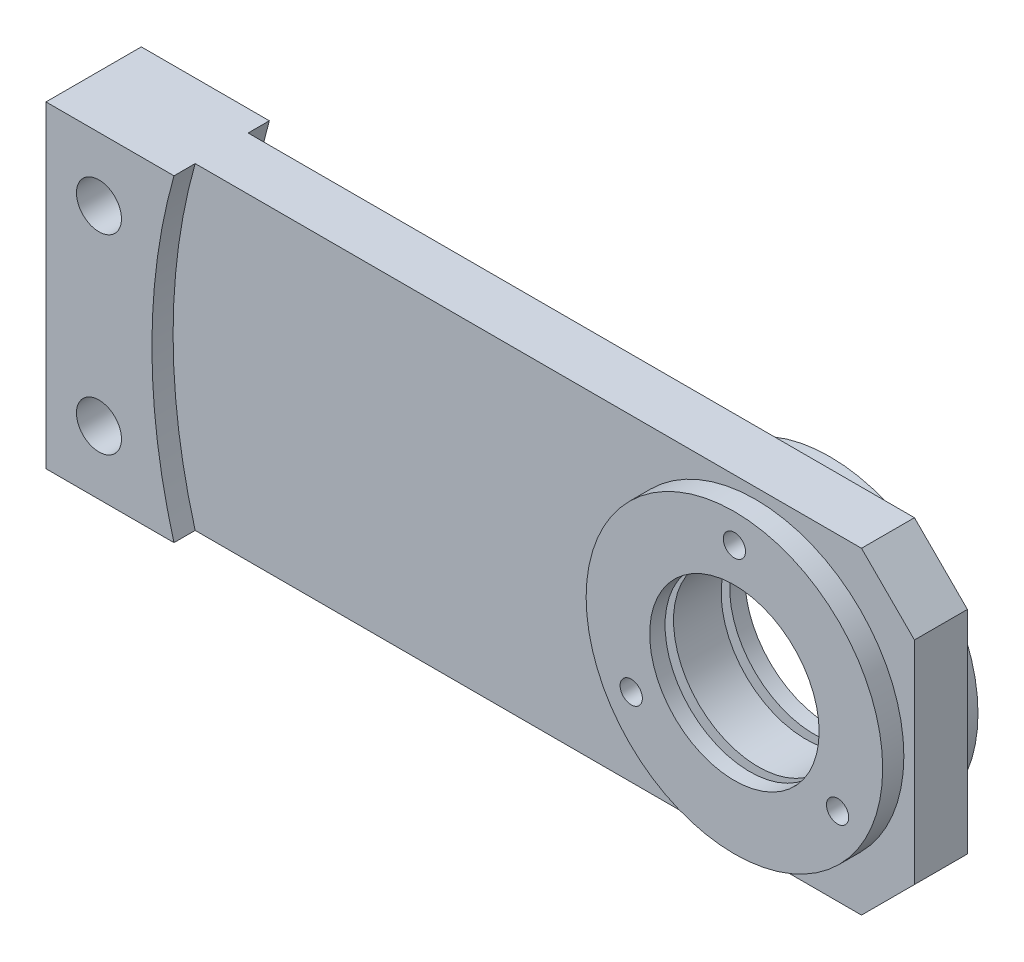
ISO-10303-21;
HEADER;
FILE_DESCRIPTION(('STEP AP214'),'2;1');
FILE_NAME('part.step','',(''),(''),'','','');
FILE_SCHEMA(('AUTOMOTIVE_DESIGN { 1 0 10303 214 1 1 1 1 }'));
ENDSEC;
DATA;
#1=APPLICATION_CONTEXT('core data for automotive mechanical design processes');
#2=APPLICATION_PROTOCOL_DEFINITION('international standard','automotive_design',2000,#1);
#3=PRODUCT_CONTEXT('',#1,'mechanical');
#4=PRODUCT('Part','Part','',(#3));
#5=PRODUCT_RELATED_PRODUCT_CATEGORY('part','',(#4));
#6=PRODUCT_DEFINITION_FORMATION('','',#4);
#7=PRODUCT_DEFINITION_CONTEXT('part definition',#1,'design');
#8=PRODUCT_DEFINITION('design','',#6,#7);
#9=PRODUCT_DEFINITION_SHAPE('','',#8);
#10=(LENGTH_UNIT() NAMED_UNIT(*) SI_UNIT(.MILLI.,.METRE.));
#11=(NAMED_UNIT(*) PLANE_ANGLE_UNIT() SI_UNIT($,.RADIAN.));
#12=(NAMED_UNIT(*) SI_UNIT($,.STERADIAN.) SOLID_ANGLE_UNIT());
#13=UNCERTAINTY_MEASURE_WITH_UNIT(LENGTH_MEASURE(1.E-05),#10,'distance_accuracy_value','');
#14=(GEOMETRIC_REPRESENTATION_CONTEXT(3) GLOBAL_UNCERTAINTY_ASSIGNED_CONTEXT((#13)) GLOBAL_UNIT_ASSIGNED_CONTEXT((#10,
#11,#12)) REPRESENTATION_CONTEXT('',''));
#15=CARTESIAN_POINT('',(0.,0.,0.));
#16=DIRECTION('',(0.,0.,1.));
#17=DIRECTION('',(1.,0.,0.));
#18=AXIS2_PLACEMENT_3D('',#15,#16,#17);
#19=CARTESIAN_POINT('',(80.,30.,9.));
#20=DIRECTION('',(-1.,0.,0.));
#21=DIRECTION('',(0.,0.,1.));
#22=AXIS2_PLACEMENT_3D('',#19,#20,#21);
#23=PLANE('',#22);
#24=DIRECTION('',(0.,1.,0.));
#25=VECTOR('',#24,1.);
#26=CARTESIAN_POINT('',(80.,0.,-5.));
#27=LINE('',#26,#25);
#28=CARTESIAN_POINT('',(80.,-20.,-5.));
#29=VERTEX_POINT('',#28);
#30=CARTESIAN_POINT('',(80.,20.,-5.));
#31=VERTEX_POINT('',#30);
#32=EDGE_CURVE('E147',#29,#31,#27,.T.);
#33=ORIENTED_EDGE('',*,*,#32,.T.);
#34=DIRECTION('',(0.,0.,1.));
#35=VECTOR('',#34,1.);
#36=CARTESIAN_POINT('',(80.,20.,9.));
#37=LINE('',#36,#35);
#38=CARTESIAN_POINT('',(80.,20.,5.));
#39=VERTEX_POINT('',#38);
#40=EDGE_CURVE('E53',#31,#39,#37,.T.);
#41=ORIENTED_EDGE('',*,*,#40,.T.);
#42=DIRECTION('',(0.,1.,0.));
#43=VECTOR('',#42,1.);
#44=CARTESIAN_POINT('',(80.,0.,5.));
#45=LINE('',#44,#43);
#46=CARTESIAN_POINT('',(80.,-20.,5.));
#47=VERTEX_POINT('',#46);
#48=EDGE_CURVE('E166',#47,#39,#45,.T.);
#49=ORIENTED_EDGE('',*,*,#48,.F.);
#50=DIRECTION('',(0.,0.,-1.));
#51=VECTOR('',#50,1.);
#52=CARTESIAN_POINT('',(80.,-20.,9.));
#53=LINE('',#52,#51);
#54=EDGE_CURVE('E154',#47,#29,#53,.T.);
#55=ORIENTED_EDGE('',*,*,#54,.T.);
#56=EDGE_LOOP('',(#33,#41,#49,#55));
#57=FACE_BOUND('',#56,.T.);
#58=ADVANCED_FACE('F44',(#57),#23,.F.);
#59=CARTESIAN_POINT('',(70.,30.,9.));
#60=DIRECTION('',(-0.707106781186549,-0.707106781186546,0.));
#61=DIRECTION('',(0.,0.,-1.));
#62=AXIS2_PLACEMENT_3D('',#59,#60,#61);
#63=PLANE('',#62);
#64=ORIENTED_EDGE('',*,*,#40,.F.);
#65=DIRECTION('',(-0.707106781186546,0.707106781186549,0.));
#66=VECTOR('',#65,1.);
#67=CARTESIAN_POINT('',(50.0000000000002,50.,-5.));
#68=LINE('',#67,#66);
#69=CARTESIAN_POINT('',(70.,30.,-5.));
#70=VERTEX_POINT('',#69);
#71=EDGE_CURVE('E133',#31,#70,#68,.T.);
#72=ORIENTED_EDGE('',*,*,#71,.T.);
#73=DIRECTION('',(0.,0.,-1.));
#74=VECTOR('',#73,1.);
#75=CARTESIAN_POINT('',(70.,30.,9.));
#76=LINE('',#75,#74);
#77=CARTESIAN_POINT('',(70.,30.,5.));
#78=VERTEX_POINT('',#77);
#79=EDGE_CURVE('E146',#78,#70,#76,.T.);
#80=ORIENTED_EDGE('',*,*,#79,.F.);
#81=DIRECTION('',(-0.707106781186546,0.707106781186549,0.));
#82=VECTOR('',#81,1.);
#83=CARTESIAN_POINT('',(50.0000000000002,50.,5.));
#84=LINE('',#83,#82);
#85=EDGE_CURVE('E170',#39,#78,#84,.T.);
#86=ORIENTED_EDGE('',*,*,#85,.F.);
#87=EDGE_LOOP('',(#64,#72,#80,#86));
#88=FACE_BOUND('',#87,.T.);
#89=ADVANCED_FACE('F144',(#88),#63,.F.);
#90=CARTESIAN_POINT('',(80.,-20.,9.));
#91=DIRECTION('',(-0.707106781186546,0.707106781186549,0.));
#92=DIRECTION('',(0.,0.,-1.));
#93=AXIS2_PLACEMENT_3D('',#90,#91,#92);
#94=PLANE('',#93);
#95=DIRECTION('',(0.,0.,1.));
#96=VECTOR('',#95,1.);
#97=CARTESIAN_POINT('',(70.,-30.,9.));
#98=LINE('',#97,#96);
#99=CARTESIAN_POINT('',(70.,-30.,-5.));
#100=VERTEX_POINT('',#99);
#101=CARTESIAN_POINT('',(70.,-30.,5.));
#102=VERTEX_POINT('',#101);
#103=EDGE_CURVE('E11',#100,#102,#98,.T.);
#104=ORIENTED_EDGE('',*,*,#103,.F.);
#105=DIRECTION('',(0.707106781186549,0.707106781186546,0.));
#106=VECTOR('',#105,1.);
#107=CARTESIAN_POINT('',(49.9999999999998,-50.0000000000001,-5.));
#108=LINE('',#107,#106);
#109=EDGE_CURVE('E295',#100,#29,#108,.T.);
#110=ORIENTED_EDGE('',*,*,#109,.T.);
#111=ORIENTED_EDGE('',*,*,#54,.F.);
#112=DIRECTION('',(0.707106781186549,0.707106781186546,0.));
#113=VECTOR('',#112,1.);
#114=CARTESIAN_POINT('',(49.9999999999998,-50.0000000000001,5.));
#115=LINE('',#114,#113);
#116=EDGE_CURVE('E172',#102,#47,#115,.T.);
#117=ORIENTED_EDGE('',*,*,#116,.F.);
#118=EDGE_LOOP('',(#104,#110,#111,#117));
#119=FACE_BOUND('',#118,.T.);
#120=ADVANCED_FACE('F47',(#119),#94,.F.);
#121=CARTESIAN_POINT('',(0.,0.,-9.));
#122=DIRECTION('',(0.,0.,-1.));
#123=DIRECTION('',(-1.,0.,0.));
#124=AXIS2_PLACEMENT_3D('',#121,#122,#123);
#125=PLANE('',#124);
#126=CARTESIAN_POINT('',(-70.,-18.,-9.));
#127=DIRECTION('',(0.,0.,1.));
#128=DIRECTION('',(1.,0.,0.));
#129=AXIS2_PLACEMENT_3D('',#126,#127,#128);
#130=CIRCLE('',#129,4.25);
#131=CARTESIAN_POINT('',(-65.75,-18.,-9.));
#132=VERTEX_POINT('',#131);
#133=EDGE_CURVE('E234',#132,#132,#130,.T.);
#134=ORIENTED_EDGE('',*,*,#133,.T.);
#135=EDGE_LOOP('',(#134));
#136=FACE_BOUND('',#135,.T.);
#137=CARTESIAN_POINT('',(-70.,18.,-9.));
#138=DIRECTION('',(0.,0.,1.));
#139=DIRECTION('',(1.,0.,0.));
#140=AXIS2_PLACEMENT_3D('',#137,#138,#139);
#141=CIRCLE('',#140,4.25);
#142=CARTESIAN_POINT('',(-65.75,18.,-9.));
#143=VERTEX_POINT('',#142);
#144=EDGE_CURVE('E240',#143,#143,#141,.T.);
#145=ORIENTED_EDGE('',*,*,#144,.T.);
#146=EDGE_LOOP('',(#145));
#147=FACE_BOUND('',#146,.T.);
#148=DIRECTION('',(-1.,0.,0.));
#149=VECTOR('',#148,1.);
#150=CARTESIAN_POINT('',(80.,30.,-9.));
#151=LINE('',#150,#149);
#152=CARTESIAN_POINT('',(-55.8300524425836,30.,-9.));
#153=VERTEX_POINT('',#152);
#154=CARTESIAN_POINT('',(-80.,30.,-9.));
#155=VERTEX_POINT('',#154);
#156=EDGE_CURVE('E253',#153,#155,#151,.T.);
#157=ORIENTED_EDGE('',*,*,#156,.F.);
#158=CARTESIAN_POINT('',(50.,0.,-9.));
#159=DIRECTION('',(0.,0.,1.));
#160=DIRECTION('',(1.,0.,0.));
#161=AXIS2_PLACEMENT_3D('',#158,#159,#160);
#162=CIRCLE('',#161,110.);
#163=CARTESIAN_POINT('',(-55.8300524425836,-30.,-9.));
#164=VERTEX_POINT('',#163);
#165=EDGE_CURVE('E275',#153,#164,#162,.T.);
#166=ORIENTED_EDGE('',*,*,#165,.T.);
#167=DIRECTION('',(1.,0.,0.));
#168=VECTOR('',#167,1.);
#169=CARTESIAN_POINT('',(80.,-30.,-9.));
#170=LINE('',#169,#168);
#171=CARTESIAN_POINT('',(-80.,-30.,-9.));
#172=VERTEX_POINT('',#171);
#173=EDGE_CURVE('E260',#172,#164,#170,.T.);
#174=ORIENTED_EDGE('',*,*,#173,.F.);
#175=DIRECTION('',(0.,-1.,0.));
#176=VECTOR('',#175,1.);
#177=CARTESIAN_POINT('',(-80.,30.,-9.));
#178=LINE('',#177,#176);
#179=EDGE_CURVE('E246',#155,#172,#178,.T.);
#180=ORIENTED_EDGE('',*,*,#179,.F.);
#181=EDGE_LOOP('',(#157,#166,#174,#180));
#182=FACE_BOUND('',#181,.T.);
#183=ADVANCED_FACE('F273',(#136,#147,#182),#125,.T.);
#184=CARTESIAN_POINT('',(80.,-30.,9.));
#185=DIRECTION('',(0.,1.,0.));
#186=DIRECTION('',(-1.,0.,0.));
#187=AXIS2_PLACEMENT_3D('',#184,#185,#186);
#188=PLANE('',#187);
#189=DIRECTION('',(0.,0.,-1.));
#190=VECTOR('',#189,1.);
#191=CARTESIAN_POINT('',(-55.8300524425836,-30.,-5.));
#192=LINE('',#191,#190);
#193=CARTESIAN_POINT('',(-55.8300524425836,-30.,-5.));
#194=VERTEX_POINT('',#193);
#195=EDGE_CURVE('E302',#194,#164,#192,.T.);
#196=ORIENTED_EDGE('',*,*,#195,.F.);
#197=DIRECTION('',(1.,0.,0.));
#198=VECTOR('',#197,1.);
#199=CARTESIAN_POINT('',(0.,-30.,-5.));
#200=LINE('',#199,#198);
#201=EDGE_CURVE('E296',#194,#100,#200,.T.);
#202=ORIENTED_EDGE('',*,*,#201,.T.);
#203=ORIENTED_EDGE('',*,*,#103,.T.);
#204=DIRECTION('',(1.,0.,0.));
#205=VECTOR('',#204,1.);
#206=CARTESIAN_POINT('',(0.,-30.,5.));
#207=LINE('',#206,#205);
#208=CARTESIAN_POINT('',(-55.8300524425836,-30.,5.));
#209=VERTEX_POINT('',#208);
#210=EDGE_CURVE('E286',#209,#102,#207,.T.);
#211=ORIENTED_EDGE('',*,*,#210,.F.);
#212=DIRECTION('',(0.,0.,1.));
#213=VECTOR('',#212,1.);
#214=CARTESIAN_POINT('',(-55.8300524425836,-30.,5.));
#215=LINE('',#214,#213);
#216=CARTESIAN_POINT('',(-55.8300524425836,-30.,9.));
#217=VERTEX_POINT('',#216);
#218=EDGE_CURVE('E176',#209,#217,#215,.T.);
#219=ORIENTED_EDGE('',*,*,#218,.T.);
#220=DIRECTION('',(1.,0.,0.));
#221=VECTOR('',#220,1.);
#222=CARTESIAN_POINT('',(80.,-30.,9.));
#223=LINE('',#222,#221);
#224=CARTESIAN_POINT('',(-80.,-30.,9.));
#225=VERTEX_POINT('',#224);
#226=EDGE_CURVE('E252',#225,#217,#223,.T.);
#227=ORIENTED_EDGE('',*,*,#226,.F.);
#228=DIRECTION('',(0.,0.,-1.));
#229=VECTOR('',#228,1.);
#230=CARTESIAN_POINT('',(-80.,-30.,9.));
#231=LINE('',#230,#229);
#232=EDGE_CURVE('E155',#225,#172,#231,.T.);
#233=ORIENTED_EDGE('',*,*,#232,.T.);
#234=ORIENTED_EDGE('',*,*,#173,.T.);
#235=EDGE_LOOP('',(#196,#202,#203,#211,#219,#227,#233,#234));
#236=FACE_BOUND('',#235,.T.);
#237=ADVANCED_FACE('F277',(#236),#188,.F.);
#238=CARTESIAN_POINT('',(80.,30.,9.));
#239=DIRECTION('',(0.,-1.,0.));
#240=DIRECTION('',(1.,0.,0.));
#241=AXIS2_PLACEMENT_3D('',#238,#239,#240);
#242=PLANE('',#241);
#243=DIRECTION('',(0.,0.,-1.));
#244=VECTOR('',#243,1.);
#245=CARTESIAN_POINT('',(-55.8300524425836,30.,-5.));
#246=LINE('',#245,#244);
#247=CARTESIAN_POINT('',(-55.8300524425836,30.,-5.));
#248=VERTEX_POINT('',#247);
#249=EDGE_CURVE('E60',#248,#153,#246,.T.);
#250=ORIENTED_EDGE('',*,*,#249,.T.);
#251=ORIENTED_EDGE('',*,*,#156,.T.);
#252=DIRECTION('',(0.,0.,-1.));
#253=VECTOR('',#252,1.);
#254=CARTESIAN_POINT('',(-80.,30.,9.));
#255=LINE('',#254,#253);
#256=CARTESIAN_POINT('',(-80.,30.,9.));
#257=VERTEX_POINT('',#256);
#258=EDGE_CURVE('E160',#257,#155,#255,.T.);
#259=ORIENTED_EDGE('',*,*,#258,.F.);
#260=DIRECTION('',(-1.,0.,0.));
#261=VECTOR('',#260,1.);
#262=CARTESIAN_POINT('',(80.,30.,9.));
#263=LINE('',#262,#261);
#264=CARTESIAN_POINT('',(-55.8300524425836,30.,9.));
#265=VERTEX_POINT('',#264);
#266=EDGE_CURVE('E256',#265,#257,#263,.T.);
#267=ORIENTED_EDGE('',*,*,#266,.F.);
#268=DIRECTION('',(0.,0.,1.));
#269=VECTOR('',#268,1.);
#270=CARTESIAN_POINT('',(-55.8300524425836,30.,5.));
#271=LINE('',#270,#269);
#272=CARTESIAN_POINT('',(-55.8300524425836,30.,5.));
#273=VERTEX_POINT('',#272);
#274=EDGE_CURVE('E174',#273,#265,#271,.T.);
#275=ORIENTED_EDGE('',*,*,#274,.F.);
#276=DIRECTION('',(-1.,0.,0.));
#277=VECTOR('',#276,1.);
#278=CARTESIAN_POINT('',(0.,30.,5.));
#279=LINE('',#278,#277);
#280=EDGE_CURVE('E153',#78,#273,#279,.T.);
#281=ORIENTED_EDGE('',*,*,#280,.F.);
#282=ORIENTED_EDGE('',*,*,#79,.T.);
#283=DIRECTION('',(-1.,0.,0.));
#284=VECTOR('',#283,1.);
#285=CARTESIAN_POINT('',(0.,30.,-5.));
#286=LINE('',#285,#284);
#287=EDGE_CURVE('E130',#70,#248,#286,.T.);
#288=ORIENTED_EDGE('',*,*,#287,.T.);
#289=EDGE_LOOP('',(#250,#251,#259,#267,#275,#281,#282,#288));
#290=FACE_BOUND('',#289,.T.);
#291=ADVANCED_FACE('F150',(#290),#242,.F.);
#292=CARTESIAN_POINT('',(0.,0.,9.));
#293=DIRECTION('',(0.,0.,-1.));
#294=DIRECTION('',(-1.,0.,0.));
#295=AXIS2_PLACEMENT_3D('',#292,#293,#294);
#296=PLANE('',#295);
#297=CARTESIAN_POINT('',(69.48557158515,-11.2499999999998,9.));
#298=DIRECTION('',(0.,0.,1.));
#299=DIRECTION('',(1.,0.,0.));
#300=AXIS2_PLACEMENT_3D('',#297,#298,#299);
#301=CIRCLE('',#300,2.09999999999999);
#302=CARTESIAN_POINT('',(71.58557158515,-11.2499999999998,9.));
#303=VERTEX_POINT('',#302);
#304=EDGE_CURVE('E210',#303,#303,#301,.T.);
#305=ORIENTED_EDGE('',*,*,#304,.F.);
#306=EDGE_LOOP('',(#305));
#307=FACE_BOUND('',#306,.T.);
#308=CARTESIAN_POINT('',(30.5144284148502,-11.2500000000001,9.));
#309=DIRECTION('',(0.,0.,1.));
#310=DIRECTION('',(1.,0.,0.));
#311=AXIS2_PLACEMENT_3D('',#308,#309,#310);
#312=CIRCLE('',#311,2.09999999999999);
#313=CARTESIAN_POINT('',(32.6144284148502,-11.2500000000001,9.));
#314=VERTEX_POINT('',#313);
#315=EDGE_CURVE('E218',#314,#314,#312,.T.);
#316=ORIENTED_EDGE('',*,*,#315,.F.);
#317=EDGE_LOOP('',(#316));
#318=FACE_BOUND('',#317,.T.);
#319=CARTESIAN_POINT('',(50.,22.5,9.));
#320=DIRECTION('',(0.,0.,1.));
#321=DIRECTION('',(1.,0.,0.));
#322=AXIS2_PLACEMENT_3D('',#319,#320,#321);
#323=CIRCLE('',#322,2.09999999999999);
#324=CARTESIAN_POINT('',(52.1,22.5,9.));
#325=VERTEX_POINT('',#324);
#326=EDGE_CURVE('E224',#325,#325,#323,.T.);
#327=ORIENTED_EDGE('',*,*,#326,.F.);
#328=EDGE_LOOP('',(#327));
#329=FACE_BOUND('',#328,.T.);
#330=CARTESIAN_POINT('',(50.,0.,9.));
#331=DIRECTION('',(0.,0.,1.));
#332=DIRECTION('',(1.,0.,0.));
#333=AXIS2_PLACEMENT_3D('',#330,#331,#332);
#334=CIRCLE('',#333,16.);
#335=CARTESIAN_POINT('',(66.,0.,9.));
#336=VERTEX_POINT('',#335);
#337=EDGE_CURVE('E231',#336,#336,#334,.T.);
#338=ORIENTED_EDGE('',*,*,#337,.F.);
#339=EDGE_LOOP('',(#338));
#340=FACE_BOUND('',#339,.T.);
#341=CARTESIAN_POINT('',(50.,0.,9.));
#342=DIRECTION('',(0.,0.,1.));
#343=DIRECTION('',(1.,0.,0.));
#344=AXIS2_PLACEMENT_3D('',#341,#342,#343);
#345=CIRCLE('',#344,28.);
#346=CARTESIAN_POINT('',(78.,0.,9.));
#347=VERTEX_POINT('',#346);
#348=EDGE_CURVE('E180',#347,#347,#345,.T.);
#349=ORIENTED_EDGE('',*,*,#348,.T.);
#350=EDGE_LOOP('',(#349));
#351=FACE_BOUND('',#350,.T.);
#352=ADVANCED_FACE('F351',(#307,#318,#329,#340,#351),#296,.F.);
#353=CARTESIAN_POINT('',(50.,0.,9.));
#354=DIRECTION('',(0.,0.,-1.));
#355=DIRECTION('',(-1.,0.,0.));
#356=AXIS2_PLACEMENT_3D('',#353,#354,#355);
#357=CYLINDRICAL_SURFACE('',#356,16.);
#358=CARTESIAN_POINT('',(50.,0.,4.5));
#359=DIRECTION('',(0.,0.,1.));
#360=DIRECTION('',(1.,0.,0.));
#361=AXIS2_PLACEMENT_3D('',#358,#359,#360);
#362=CIRCLE('',#361,16.);
#363=CARTESIAN_POINT('',(66.,0.,4.5));
#364=VERTEX_POINT('',#363);
#365=EDGE_CURVE('E198',#364,#364,#362,.T.);
#366=ORIENTED_EDGE('',*,*,#365,.T.);
#367=EDGE_LOOP('',(#366));
#368=FACE_BOUND('',#367,.T.);
#369=CARTESIAN_POINT('',(50.,0.,-4.5));
#370=DIRECTION('',(0.,0.,1.));
#371=DIRECTION('',(1.,0.,0.));
#372=AXIS2_PLACEMENT_3D('',#369,#370,#371);
#373=CIRCLE('',#372,16.);
#374=CARTESIAN_POINT('',(66.,0.,-4.5));
#375=VERTEX_POINT('',#374);
#376=EDGE_CURVE('E187',#375,#375,#373,.T.);
#377=ORIENTED_EDGE('',*,*,#376,.F.);
#378=EDGE_LOOP('',(#377));
#379=FACE_BOUND('',#378,.T.);
#380=ADVANCED_FACE('F374',(#368,#379),#357,.F.);
#381=CARTESIAN_POINT('',(50.,0.,-6.1));
#382=DIRECTION('',(0.,0.,1.));
#383=DIRECTION('',(1.,0.,0.));
#384=AXIS2_PLACEMENT_3D('',#381,#382,#383);
#385=CIRCLE('',#384,16.);
#386=CARTESIAN_POINT('',(66.,0.,-6.1));
#387=VERTEX_POINT('',#386);
#388=EDGE_CURVE('E189',#387,#387,#385,.T.);
#389=ORIENTED_EDGE('',*,*,#388,.T.);
#390=EDGE_LOOP('',(#389));
#391=FACE_BOUND('',#390,.T.);
#392=CARTESIAN_POINT('',(50.,0.,-9.));
#393=DIRECTION('',(0.,0.,1.));
#394=DIRECTION('',(1.,0.,0.));
#395=AXIS2_PLACEMENT_3D('',#392,#393,#394);
#396=CIRCLE('',#395,16.);
#397=CARTESIAN_POINT('',(66.,0.,-9.));
#398=VERTEX_POINT('',#397);
#399=EDGE_CURVE('E230',#398,#398,#396,.T.);
#400=ORIENTED_EDGE('',*,*,#399,.F.);
#401=EDGE_LOOP('',(#400));
#402=FACE_BOUND('',#401,.T.);
#403=ADVANCED_FACE('F349',(#391,#402),#357,.F.);
#404=ORIENTED_EDGE('',*,*,#226,.T.);
#405=CARTESIAN_POINT('',(50.,0.,9.));
#406=DIRECTION('',(0.,0.,1.));
#407=DIRECTION('',(1.,0.,0.));
#408=AXIS2_PLACEMENT_3D('',#405,#406,#407);
#409=CIRCLE('',#408,110.);
#410=EDGE_CURVE('E183',#265,#217,#409,.T.);
#411=ORIENTED_EDGE('',*,*,#410,.F.);
#412=ORIENTED_EDGE('',*,*,#266,.T.);
#413=DIRECTION('',(0.,-1.,0.));
#414=VECTOR('',#413,1.);
#415=CARTESIAN_POINT('',(-80.,30.,9.));
#416=LINE('',#415,#414);
#417=EDGE_CURVE('E249',#257,#225,#416,.T.);
#418=ORIENTED_EDGE('',*,*,#417,.T.);
#419=EDGE_LOOP('',(#404,#411,#412,#418));
#420=FACE_BOUND('',#419,.T.);
#421=CARTESIAN_POINT('',(-70.,18.,9.));
#422=DIRECTION('',(0.,0.,1.));
#423=DIRECTION('',(1.,0.,0.));
#424=AXIS2_PLACEMENT_3D('',#421,#422,#423);
#425=CIRCLE('',#424,4.25);
#426=CARTESIAN_POINT('',(-65.75,18.,9.));
#427=VERTEX_POINT('',#426);
#428=EDGE_CURVE('E243',#427,#427,#425,.T.);
#429=ORIENTED_EDGE('',*,*,#428,.F.);
#430=EDGE_LOOP('',(#429));
#431=FACE_BOUND('',#430,.T.);
#432=CARTESIAN_POINT('',(-70.,-18.,9.));
#433=DIRECTION('',(0.,0.,1.));
#434=DIRECTION('',(1.,0.,0.));
#435=AXIS2_PLACEMENT_3D('',#432,#433,#434);
#436=CIRCLE('',#435,4.25);
#437=CARTESIAN_POINT('',(-65.75,-18.,9.));
#438=VERTEX_POINT('',#437);
#439=EDGE_CURVE('E237',#438,#438,#436,.T.);
#440=ORIENTED_EDGE('',*,*,#439,.F.);
#441=EDGE_LOOP('',(#440));
#442=FACE_BOUND('',#441,.T.);
#443=ADVANCED_FACE('F280',(#420,#431,#442),#296,.F.);
#444=CARTESIAN_POINT('',(50.,0.,-9.));
#445=DIRECTION('',(0.,0.,1.));
#446=DIRECTION('',(1.,0.,0.));
#447=AXIS2_PLACEMENT_3D('',#444,#445,#446);
#448=CIRCLE('',#447,28.);
#449=CARTESIAN_POINT('',(78.,0.,-9.));
#450=VERTEX_POINT('',#449);
#451=EDGE_CURVE('E303',#450,#450,#448,.T.);
#452=ORIENTED_EDGE('',*,*,#451,.F.);
#453=EDGE_LOOP('',(#452));
#454=FACE_BOUND('',#453,.T.);
#455=ORIENTED_EDGE('',*,*,#399,.T.);
#456=EDGE_LOOP('',(#455));
#457=FACE_BOUND('',#456,.T.);
#458=ADVANCED_FACE('F332',(#454,#457),#125,.T.);
#459=CARTESIAN_POINT('',(-80.,30.,9.));
#460=DIRECTION('',(1.,0.,0.));
#461=DIRECTION('',(0.,0.,-1.));
#462=AXIS2_PLACEMENT_3D('',#459,#460,#461);
#463=PLANE('',#462);
#464=ORIENTED_EDGE('',*,*,#179,.T.);
#465=ORIENTED_EDGE('',*,*,#232,.F.);
#466=ORIENTED_EDGE('',*,*,#417,.F.);
#467=ORIENTED_EDGE('',*,*,#258,.T.);
#468=EDGE_LOOP('',(#464,#465,#466,#467));
#469=FACE_BOUND('',#468,.T.);
#470=ADVANCED_FACE('F268',(#469),#463,.F.);
#471=CARTESIAN_POINT('',(-70.,18.,9.));
#472=DIRECTION('',(0.,0.,-1.));
#473=DIRECTION('',(-1.,0.,0.));
#474=AXIS2_PLACEMENT_3D('',#471,#472,#473);
#475=CYLINDRICAL_SURFACE('',#474,4.25);
#476=ORIENTED_EDGE('',*,*,#428,.T.);
#477=EDGE_LOOP('',(#476));
#478=FACE_BOUND('',#477,.T.);
#479=ORIENTED_EDGE('',*,*,#144,.F.);
#480=EDGE_LOOP('',(#479));
#481=FACE_BOUND('',#480,.T.);
#482=ADVANCED_FACE('F331',(#478,#481),#475,.F.);
#483=CARTESIAN_POINT('',(-70.,-18.,9.));
#484=DIRECTION('',(0.,0.,-1.));
#485=DIRECTION('',(-1.,0.,0.));
#486=AXIS2_PLACEMENT_3D('',#483,#484,#485);
#487=CYLINDRICAL_SURFACE('',#486,4.25);
#488=ORIENTED_EDGE('',*,*,#439,.T.);
#489=EDGE_LOOP('',(#488));
#490=FACE_BOUND('',#489,.T.);
#491=ORIENTED_EDGE('',*,*,#133,.F.);
#492=EDGE_LOOP('',(#491));
#493=FACE_BOUND('',#492,.T.);
#494=ADVANCED_FACE('F342',(#490,#493),#487,.F.);
#495=CARTESIAN_POINT('',(50.,0.,6.1));
#496=DIRECTION('',(0.,0.,1.));
#497=DIRECTION('',(1.,0.,0.));
#498=AXIS2_PLACEMENT_3D('',#495,#496,#497);
#499=CIRCLE('',#498,16.);
#500=CARTESIAN_POINT('',(66.,0.,6.1));
#501=VERTEX_POINT('',#500);
#502=EDGE_CURVE('E201',#501,#501,#499,.T.);
#503=ORIENTED_EDGE('',*,*,#502,.F.);
#504=EDGE_LOOP('',(#503));
#505=FACE_BOUND('',#504,.T.);
#506=ORIENTED_EDGE('',*,*,#337,.T.);
#507=EDGE_LOOP('',(#506));
#508=FACE_BOUND('',#507,.T.);
#509=ADVANCED_FACE('F365',(#505,#508),#357,.F.);
#510=CARTESIAN_POINT('',(50.,22.5,-1.));
#511=DIRECTION('',(0.,0.,1.));
#512=DIRECTION('',(1.,0.,0.));
#513=AXIS2_PLACEMENT_3D('',#510,#511,#512);
#514=CONICAL_SURFACE('',#513,2.1,1.02974425867665);
#515=CARTESIAN_POINT('',(50.,22.5,-2.26180729995788));
#516=VERTEX_POINT('',#515);
#517=VERTEX_LOOP('',#516);
#518=FACE_BOUND('',#517,.T.);
#519=CARTESIAN_POINT('',(50.,22.5,-1.));
#520=DIRECTION('',(0.,0.,1.));
#521=DIRECTION('',(1.,0.,0.));
#522=AXIS2_PLACEMENT_3D('',#519,#520,#521);
#523=CIRCLE('',#522,2.1);
#524=CARTESIAN_POINT('',(52.1,22.5,-1.));
#525=VERTEX_POINT('',#524);
#526=EDGE_CURVE('E227',#525,#525,#523,.T.);
#527=ORIENTED_EDGE('',*,*,#526,.T.);
#528=EDGE_LOOP('',(#527));
#529=FACE_BOUND('',#528,.T.);
#530=ADVANCED_FACE('F371',(#518,#529),#514,.F.);
#531=CARTESIAN_POINT('',(50.,22.5,9.));
#532=DIRECTION('',(0.,0.,1.));
#533=DIRECTION('',(1.,0.,0.));
#534=AXIS2_PLACEMENT_3D('',#531,#532,#533);
#535=CYLINDRICAL_SURFACE('',#534,2.09999999999999);
#536=ORIENTED_EDGE('',*,*,#526,.F.);
#537=EDGE_LOOP('',(#536));
#538=FACE_BOUND('',#537,.T.);
#539=ORIENTED_EDGE('',*,*,#326,.T.);
#540=EDGE_LOOP('',(#539));
#541=FACE_BOUND('',#540,.T.);
#542=ADVANCED_FACE('F378',(#538,#541),#535,.F.);
#543=CARTESIAN_POINT('',(30.5144284148502,-11.2500000000001,-1.));
#544=DIRECTION('',(0.,0.,1.));
#545=DIRECTION('',(1.,0.,0.));
#546=AXIS2_PLACEMENT_3D('',#543,#544,#545);
#547=CONICAL_SURFACE('',#546,2.1,1.02974425867665);
#548=CARTESIAN_POINT('',(30.5144284148502,-11.2500000000001,-2.26180729995788));
#549=VERTEX_POINT('',#548);
#550=VERTEX_LOOP('',#549);
#551=FACE_BOUND('',#550,.T.);
#552=CARTESIAN_POINT('',(30.5144284148502,-11.2500000000001,-1.));
#553=DIRECTION('',(0.,0.,1.));
#554=DIRECTION('',(1.,0.,0.));
#555=AXIS2_PLACEMENT_3D('',#552,#553,#554);
#556=CIRCLE('',#555,2.1);
#557=CARTESIAN_POINT('',(32.6144284148502,-11.2500000000001,-1.));
#558=VERTEX_POINT('',#557);
#559=EDGE_CURVE('E221',#558,#558,#556,.T.);
#560=ORIENTED_EDGE('',*,*,#559,.T.);
#561=EDGE_LOOP('',(#560));
#562=FACE_BOUND('',#561,.T.);
#563=ADVANCED_FACE('F382',(#551,#562),#547,.F.);
#564=CARTESIAN_POINT('',(30.5144284148502,-11.2500000000001,9.));
#565=DIRECTION('',(0.,0.,1.));
#566=DIRECTION('',(1.,0.,0.));
#567=AXIS2_PLACEMENT_3D('',#564,#565,#566);
#568=CYLINDRICAL_SURFACE('',#567,2.09999999999999);
#569=ORIENTED_EDGE('',*,*,#559,.F.);
#570=EDGE_LOOP('',(#569));
#571=FACE_BOUND('',#570,.T.);
#572=ORIENTED_EDGE('',*,*,#315,.T.);
#573=EDGE_LOOP('',(#572));
#574=FACE_BOUND('',#573,.T.);
#575=ADVANCED_FACE('F386',(#571,#574),#568,.F.);
#576=CARTESIAN_POINT('',(69.48557158515,-11.2499999999998,-1.));
#577=DIRECTION('',(0.,0.,1.));
#578=DIRECTION('',(1.,0.,0.));
#579=AXIS2_PLACEMENT_3D('',#576,#577,#578);
#580=CONICAL_SURFACE('',#579,2.09999999999999,1.02974425867665);
#581=CARTESIAN_POINT('',(69.48557158515,-11.2499999999998,-2.26180729995788));
#582=VERTEX_POINT('',#581);
#583=VERTEX_LOOP('',#582);
#584=FACE_BOUND('',#583,.T.);
#585=CARTESIAN_POINT('',(69.48557158515,-11.2499999999998,-1.));
#586=DIRECTION('',(0.,0.,1.));
#587=DIRECTION('',(1.,0.,0.));
#588=AXIS2_PLACEMENT_3D('',#585,#586,#587);
#589=CIRCLE('',#588,2.09999999999999);
#590=CARTESIAN_POINT('',(71.58557158515,-11.2499999999998,-1.));
#591=VERTEX_POINT('',#590);
#592=EDGE_CURVE('E215',#591,#591,#589,.T.);
#593=ORIENTED_EDGE('',*,*,#592,.T.);
#594=EDGE_LOOP('',(#593));
#595=FACE_BOUND('',#594,.T.);
#596=ADVANCED_FACE('F390',(#584,#595),#580,.F.);
#597=CARTESIAN_POINT('',(69.48557158515,-11.2499999999998,9.));
#598=DIRECTION('',(0.,0.,1.));
#599=DIRECTION('',(1.,0.,0.));
#600=AXIS2_PLACEMENT_3D('',#597,#598,#599);
#601=CYLINDRICAL_SURFACE('',#600,2.09999999999999);
#602=ORIENTED_EDGE('',*,*,#592,.F.);
#603=EDGE_LOOP('',(#602));
#604=FACE_BOUND('',#603,.T.);
#605=ORIENTED_EDGE('',*,*,#304,.T.);
#606=EDGE_LOOP('',(#605));
#607=FACE_BOUND('',#606,.T.);
#608=ADVANCED_FACE('F394',(#604,#607),#601,.F.);
#609=CARTESIAN_POINT('',(50.,0.,6.1));
#610=DIRECTION('',(0.,0.,1.));
#611=DIRECTION('',(1.,0.,0.));
#612=AXIS2_PLACEMENT_3D('',#609,#610,#611);
#613=PLANE('',#612);
#614=CARTESIAN_POINT('',(50.,0.,6.1));
#615=DIRECTION('',(0.,0.,1.));
#616=DIRECTION('',(1.,0.,0.));
#617=AXIS2_PLACEMENT_3D('',#614,#615,#616);
#618=CIRCLE('',#617,18.5);
#619=CARTESIAN_POINT('',(68.5,0.,6.1));
#620=VERTEX_POINT('',#619);
#621=EDGE_CURVE('E207',#620,#620,#618,.T.);
#622=ORIENTED_EDGE('',*,*,#621,.F.);
#623=EDGE_LOOP('',(#622));
#624=FACE_BOUND('',#623,.T.);
#625=ORIENTED_EDGE('',*,*,#502,.T.);
#626=EDGE_LOOP('',(#625));
#627=FACE_BOUND('',#626,.T.);
#628=ADVANCED_FACE('F398',(#624,#627),#613,.F.);
#629=CARTESIAN_POINT('',(50.,0.,4.5));
#630=DIRECTION('',(0.,0.,1.));
#631=DIRECTION('',(1.,0.,0.));
#632=AXIS2_PLACEMENT_3D('',#629,#630,#631);
#633=PLANE('',#632);
#634=CARTESIAN_POINT('',(50.,0.,4.5));
#635=DIRECTION('',(0.,0.,1.));
#636=DIRECTION('',(1.,0.,0.));
#637=AXIS2_PLACEMENT_3D('',#634,#635,#636);
#638=CIRCLE('',#637,18.5);
#639=CARTESIAN_POINT('',(68.5,0.,4.5));
#640=VERTEX_POINT('',#639);
#641=EDGE_CURVE('E204',#640,#640,#638,.T.);
#642=ORIENTED_EDGE('',*,*,#641,.T.);
#643=EDGE_LOOP('',(#642));
#644=FACE_BOUND('',#643,.T.);
#645=ORIENTED_EDGE('',*,*,#365,.F.);
#646=EDGE_LOOP('',(#645));
#647=FACE_BOUND('',#646,.T.);
#648=ADVANCED_FACE('F404',(#644,#647),#633,.T.);
#649=CARTESIAN_POINT('',(50.,0.,6.1));
#650=DIRECTION('',(0.,0.,-1.));
#651=DIRECTION('',(-1.,0.,0.));
#652=AXIS2_PLACEMENT_3D('',#649,#650,#651);
#653=CYLINDRICAL_SURFACE('',#652,18.5);
#654=ORIENTED_EDGE('',*,*,#621,.T.);
#655=EDGE_LOOP('',(#654));
#656=FACE_BOUND('',#655,.T.);
#657=ORIENTED_EDGE('',*,*,#641,.F.);
#658=EDGE_LOOP('',(#657));
#659=FACE_BOUND('',#658,.T.);
#660=ADVANCED_FACE('F400',(#656,#659),#653,.F.);
#661=CARTESIAN_POINT('',(50.,0.,-6.1));
#662=DIRECTION('',(0.,0.,1.));
#663=DIRECTION('',(1.,0.,0.));
#664=AXIS2_PLACEMENT_3D('',#661,#662,#663);
#665=CYLINDRICAL_SURFACE('',#664,18.5);
#666=CARTESIAN_POINT('',(50.,0.,-6.1));
#667=DIRECTION('',(0.,0.,1.));
#668=DIRECTION('',(1.,0.,0.));
#669=AXIS2_PLACEMENT_3D('',#666,#667,#668);
#670=CIRCLE('',#669,18.5);
#671=CARTESIAN_POINT('',(68.5,0.,-6.1));
#672=VERTEX_POINT('',#671);
#673=EDGE_CURVE('E195',#672,#672,#670,.T.);
#674=ORIENTED_EDGE('',*,*,#673,.F.);
#675=EDGE_LOOP('',(#674));
#676=FACE_BOUND('',#675,.T.);
#677=CARTESIAN_POINT('',(50.,0.,-4.5));
#678=DIRECTION('',(0.,0.,1.));
#679=DIRECTION('',(1.,0.,0.));
#680=AXIS2_PLACEMENT_3D('',#677,#678,#679);
#681=CIRCLE('',#680,18.5);
#682=CARTESIAN_POINT('',(68.5,0.,-4.5));
#683=VERTEX_POINT('',#682);
#684=EDGE_CURVE('E192',#683,#683,#681,.T.);
#685=ORIENTED_EDGE('',*,*,#684,.T.);
#686=EDGE_LOOP('',(#685));
#687=FACE_BOUND('',#686,.T.);
#688=ADVANCED_FACE('F403',(#676,#687),#665,.F.);
#689=CARTESIAN_POINT('',(50.,0.,-6.1));
#690=DIRECTION('',(0.,0.,-1.));
#691=DIRECTION('',(1.,0.,0.));
#692=AXIS2_PLACEMENT_3D('',#689,#690,#691);
#693=PLANE('',#692);
#694=ORIENTED_EDGE('',*,*,#388,.F.);
#695=EDGE_LOOP('',(#694));
#696=FACE_BOUND('',#695,.T.);
#697=ORIENTED_EDGE('',*,*,#673,.T.);
#698=EDGE_LOOP('',(#697));
#699=FACE_BOUND('',#698,.T.);
#700=ADVANCED_FACE('F414',(#696,#699),#693,.F.);
#701=CARTESIAN_POINT('',(50.,0.,-4.5));
#702=DIRECTION('',(0.,0.,-1.));
#703=DIRECTION('',(1.,0.,0.));
#704=AXIS2_PLACEMENT_3D('',#701,#702,#703);
#705=PLANE('',#704);
#706=ORIENTED_EDGE('',*,*,#376,.T.);
#707=EDGE_LOOP('',(#706));
#708=FACE_BOUND('',#707,.T.);
#709=ORIENTED_EDGE('',*,*,#684,.F.);
#710=EDGE_LOOP('',(#709));
#711=FACE_BOUND('',#710,.T.);
#712=ADVANCED_FACE('F416',(#708,#711),#705,.T.);
#713=CARTESIAN_POINT('',(50.,0.,5.));
#714=DIRECTION('',(0.,0.,1.));
#715=DIRECTION('',(1.,0.,0.));
#716=AXIS2_PLACEMENT_3D('',#713,#714,#715);
#717=CYLINDRICAL_SURFACE('',#716,28.);
#718=CARTESIAN_POINT('',(50.,0.,5.));
#719=DIRECTION('',(0.,0.,1.));
#720=DIRECTION('',(1.,0.,0.));
#721=AXIS2_PLACEMENT_3D('',#718,#719,#720);
#722=CIRCLE('',#721,28.);
#723=CARTESIAN_POINT('',(78.,0.,5.));
#724=VERTEX_POINT('',#723);
#725=EDGE_CURVE('E185',#724,#724,#722,.T.);
#726=ORIENTED_EDGE('',*,*,#725,.T.);
#727=EDGE_LOOP('',(#726));
#728=FACE_BOUND('',#727,.T.);
#729=ORIENTED_EDGE('',*,*,#348,.F.);
#730=EDGE_LOOP('',(#729));
#731=FACE_BOUND('',#730,.T.);
#732=ADVANCED_FACE('F419',(#728,#731),#717,.T.);
#733=CARTESIAN_POINT('',(50.,0.,5.));
#734=DIRECTION('',(0.,0.,1.));
#735=DIRECTION('',(1.,0.,0.));
#736=AXIS2_PLACEMENT_3D('',#733,#734,#735);
#737=CYLINDRICAL_SURFACE('',#736,110.);
#738=ORIENTED_EDGE('',*,*,#410,.T.);
#739=ORIENTED_EDGE('',*,*,#218,.F.);
#740=CARTESIAN_POINT('',(50.,0.,5.));
#741=DIRECTION('',(0.,0.,1.));
#742=DIRECTION('',(1.,0.,0.));
#743=AXIS2_PLACEMENT_3D('',#740,#741,#742);
#744=CIRCLE('',#743,110.);
#745=EDGE_CURVE('E285',#273,#209,#744,.T.);
#746=ORIENTED_EDGE('',*,*,#745,.F.);
#747=ORIENTED_EDGE('',*,*,#274,.T.);
#748=EDGE_LOOP('',(#738,#739,#746,#747));
#749=FACE_BOUND('',#748,.T.);
#750=ADVANCED_FACE('F283',(#749),#737,.F.);
#751=CARTESIAN_POINT('',(0.,0.,5.));
#752=DIRECTION('',(0.,0.,1.));
#753=DIRECTION('',(1.,0.,0.));
#754=AXIS2_PLACEMENT_3D('',#751,#752,#753);
#755=PLANE('',#754);
#756=ORIENTED_EDGE('',*,*,#725,.F.);
#757=EDGE_LOOP('',(#756));
#758=FACE_BOUND('',#757,.T.);
#759=ORIENTED_EDGE('',*,*,#280,.T.);
#760=ORIENTED_EDGE('',*,*,#745,.T.);
#761=ORIENTED_EDGE('',*,*,#210,.T.);
#762=ORIENTED_EDGE('',*,*,#116,.T.);
#763=ORIENTED_EDGE('',*,*,#48,.T.);
#764=ORIENTED_EDGE('',*,*,#85,.T.);
#765=EDGE_LOOP('',(#759,#760,#761,#762,#763,#764));
#766=FACE_BOUND('',#765,.T.);
#767=ADVANCED_FACE('F169',(#758,#766),#755,.T.);
#768=CARTESIAN_POINT('',(50.,0.,-5.));
#769=DIRECTION('',(0.,0.,-1.));
#770=DIRECTION('',(-1.,0.,0.));
#771=AXIS2_PLACEMENT_3D('',#768,#769,#770);
#772=CYLINDRICAL_SURFACE('',#771,110.);
#773=ORIENTED_EDGE('',*,*,#165,.F.);
#774=ORIENTED_EDGE('',*,*,#249,.F.);
#775=CARTESIAN_POINT('',(50.,0.,-5.));
#776=DIRECTION('',(0.,0.,1.));
#777=DIRECTION('',(1.,0.,0.));
#778=AXIS2_PLACEMENT_3D('',#775,#776,#777);
#779=CIRCLE('',#778,110.);
#780=EDGE_CURVE('E136',#248,#194,#779,.T.);
#781=ORIENTED_EDGE('',*,*,#780,.T.);
#782=ORIENTED_EDGE('',*,*,#195,.T.);
#783=EDGE_LOOP('',(#773,#774,#781,#782));
#784=FACE_BOUND('',#783,.T.);
#785=ADVANCED_FACE('F307',(#784),#772,.F.);
#786=CARTESIAN_POINT('',(50.,0.,-5.));
#787=DIRECTION('',(0.,0.,-1.));
#788=DIRECTION('',(-1.,0.,0.));
#789=AXIS2_PLACEMENT_3D('',#786,#787,#788);
#790=CYLINDRICAL_SURFACE('',#789,28.);
#791=CARTESIAN_POINT('',(50.,0.,-5.));
#792=DIRECTION('',(0.,0.,1.));
#793=DIRECTION('',(1.,0.,0.));
#794=AXIS2_PLACEMENT_3D('',#791,#792,#793);
#795=CIRCLE('',#794,28.);
#796=CARTESIAN_POINT('',(78.,0.,-5.));
#797=VERTEX_POINT('',#796);
#798=EDGE_CURVE('E139',#797,#797,#795,.T.);
#799=ORIENTED_EDGE('',*,*,#798,.F.);
#800=EDGE_LOOP('',(#799));
#801=FACE_BOUND('',#800,.T.);
#802=ORIENTED_EDGE('',*,*,#451,.T.);
#803=EDGE_LOOP('',(#802));
#804=FACE_BOUND('',#803,.T.);
#805=ADVANCED_FACE('F309',(#801,#804),#790,.T.);
#806=CARTESIAN_POINT('',(0.,0.,-5.));
#807=DIRECTION('',(0.,0.,-1.));
#808=DIRECTION('',(1.,0.,0.));
#809=AXIS2_PLACEMENT_3D('',#806,#807,#808);
#810=PLANE('',#809);
#811=ORIENTED_EDGE('',*,*,#798,.T.);
#812=EDGE_LOOP('',(#811));
#813=FACE_BOUND('',#812,.T.);
#814=ORIENTED_EDGE('',*,*,#287,.F.);
#815=ORIENTED_EDGE('',*,*,#71,.F.);
#816=ORIENTED_EDGE('',*,*,#32,.F.);
#817=ORIENTED_EDGE('',*,*,#109,.F.);
#818=ORIENTED_EDGE('',*,*,#201,.F.);
#819=ORIENTED_EDGE('',*,*,#780,.F.);
#820=EDGE_LOOP('',(#814,#815,#816,#817,#818,#819));
#821=FACE_BOUND('',#820,.T.);
#822=ADVANCED_FACE('F132',(#813,#821),#810,.T.);
#823=CLOSED_SHELL('',(#58,#89,#120,#183,#237,#291,#352,#380,#403,#443,#458,#470,#482,#494,#509,
#530,#542,#563,#575,#596,#608,#628,#648,#660,#688,#700,#712,#732,#750,#767,#785,#805,#822));
#824=MANIFOLD_SOLID_BREP('B2',#823);
#825=ADVANCED_BREP_SHAPE_REPRESENTATION('',(#18,#824),#14);
#826=SHAPE_DEFINITION_REPRESENTATION(#9,#825);
ENDSEC;
END-ISO-10303-21;
